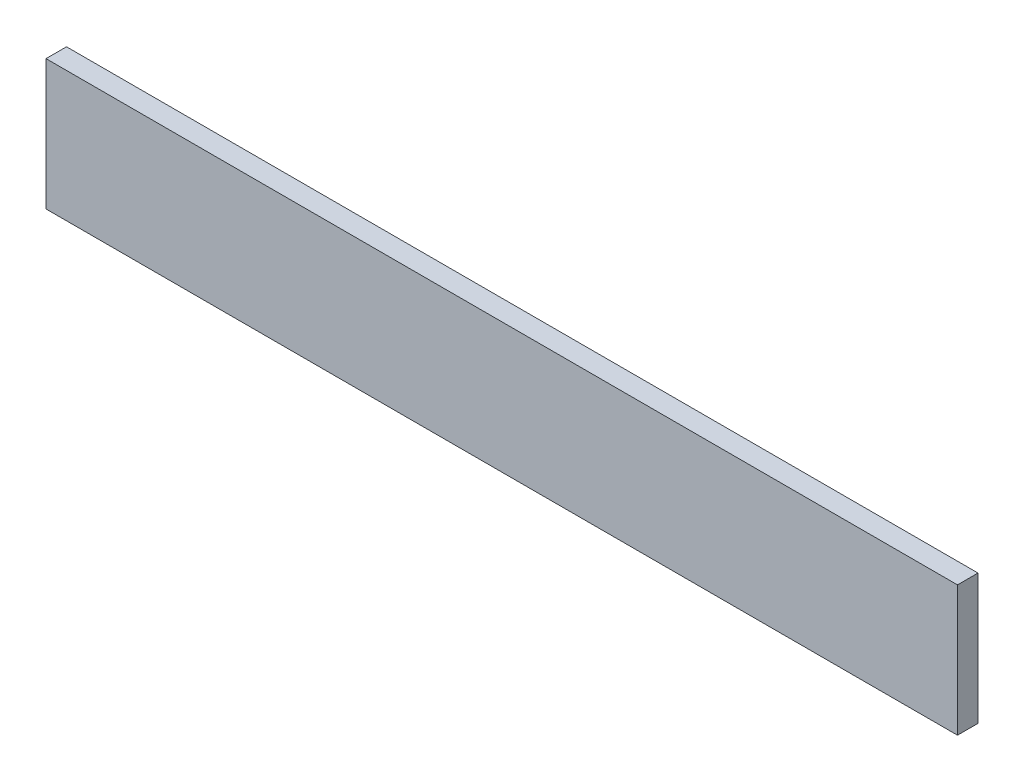
ISO-10303-21;
HEADER;
FILE_DESCRIPTION(('STEP AP214'),'2;1');
FILE_NAME('part.step','',(''),(''),'','','');
FILE_SCHEMA(('AUTOMOTIVE_DESIGN { 1 0 10303 214 1 1 1 1 }'));
ENDSEC;
DATA;
#1=APPLICATION_CONTEXT('core data for automotive mechanical design processes');
#2=APPLICATION_PROTOCOL_DEFINITION('international standard','automotive_design',2000,#1);
#3=PRODUCT_CONTEXT('',#1,'mechanical');
#4=PRODUCT('Part','Part','',(#3));
#5=PRODUCT_RELATED_PRODUCT_CATEGORY('part','',(#4));
#6=PRODUCT_DEFINITION_FORMATION('','',#4);
#7=PRODUCT_DEFINITION_CONTEXT('part definition',#1,'design');
#8=PRODUCT_DEFINITION('design','',#6,#7);
#9=PRODUCT_DEFINITION_SHAPE('','',#8);
#10=(LENGTH_UNIT() NAMED_UNIT(*) SI_UNIT(.MILLI.,.METRE.));
#11=(NAMED_UNIT(*) PLANE_ANGLE_UNIT() SI_UNIT($,.RADIAN.));
#12=(NAMED_UNIT(*) SI_UNIT($,.STERADIAN.) SOLID_ANGLE_UNIT());
#13=UNCERTAINTY_MEASURE_WITH_UNIT(LENGTH_MEASURE(1.E-05),#10,'distance_accuracy_value','');
#14=(GEOMETRIC_REPRESENTATION_CONTEXT(3) GLOBAL_UNCERTAINTY_ASSIGNED_CONTEXT((#13)) GLOBAL_UNIT_ASSIGNED_CONTEXT((#10,
#11,#12)) REPRESENTATION_CONTEXT('',''));
#15=CARTESIAN_POINT('',(0.,0.,0.));
#16=DIRECTION('',(0.,0.,1.));
#17=DIRECTION('',(1.,0.,0.));
#18=AXIS2_PLACEMENT_3D('',#15,#16,#17);
#19=CARTESIAN_POINT('',(-0.889,-0.127,0.03999992));
#20=DIRECTION('',(0.,0.,1.));
#21=DIRECTION('',(1.,0.,0.));
#22=AXIS2_PLACEMENT_3D('',#19,#20,#21);
#23=PLANE('',#22);
#24=DIRECTION('',(1.,0.,0.));
#25=VECTOR('',#24,1.);
#26=CARTESIAN_POINT('',(-0.889,0.127,0.03999992));
#27=LINE('',#26,#25);
#28=CARTESIAN_POINT('',(-0.889,0.127,0.03999992));
#29=VERTEX_POINT('',#28);
#30=CARTESIAN_POINT('',(0.889,0.127,0.03999992));
#31=VERTEX_POINT('',#30);
#32=EDGE_CURVE('E53',#29,#31,#27,.T.);
#33=ORIENTED_EDGE('',*,*,#32,.F.);
#34=DIRECTION('',(0.,1.,0.));
#35=VECTOR('',#34,1.);
#36=CARTESIAN_POINT('',(-0.889,-0.127,0.03999992));
#37=LINE('',#36,#35);
#38=CARTESIAN_POINT('',(-0.889,-0.127,0.03999992));
#39=VERTEX_POINT('',#38);
#40=EDGE_CURVE('E20',#29,#39,#37,.F.);
#41=ORIENTED_EDGE('',*,*,#40,.T.);
#42=DIRECTION('',(1.,0.,0.));
#43=VECTOR('',#42,1.);
#44=CARTESIAN_POINT('',(0.889,-0.127,0.03999992));
#45=LINE('',#44,#43);
#46=CARTESIAN_POINT('',(0.889,-0.127,0.03999992));
#47=VERTEX_POINT('',#46);
#48=EDGE_CURVE('E67',#47,#39,#45,.F.);
#49=ORIENTED_EDGE('',*,*,#48,.F.);
#50=DIRECTION('',(0.,1.,0.));
#51=VECTOR('',#50,1.);
#52=CARTESIAN_POINT('',(0.889,0.127,0.03999992));
#53=LINE('',#52,#51);
#54=EDGE_CURVE('E58',#31,#47,#53,.F.);
#55=ORIENTED_EDGE('',*,*,#54,.F.);
#56=EDGE_LOOP('',(#33,#41,#49,#55));
#57=FACE_BOUND('',#56,.T.);
#58=ADVANCED_FACE('F17',(#57),#23,.T.);
#59=CARTESIAN_POINT('',(0.889,-0.127,0.));
#60=DIRECTION('',(0.,-1.,0.));
#61=DIRECTION('',(0.,0.,-1.));
#62=AXIS2_PLACEMENT_3D('',#59,#60,#61);
#63=PLANE('',#62);
#64=DIRECTION('',(0.,0.,1.));
#65=VECTOR('',#64,1.);
#66=CARTESIAN_POINT('',(-0.889,-0.127,0.));
#67=LINE('',#66,#65);
#68=CARTESIAN_POINT('',(-0.889,-0.127,0.));
#69=VERTEX_POINT('',#68);
#70=EDGE_CURVE('E80',#69,#39,#67,.T.);
#71=ORIENTED_EDGE('',*,*,#70,.F.);
#72=DIRECTION('',(1.,0.,0.));
#73=VECTOR('',#72,1.);
#74=CARTESIAN_POINT('',(-0.889,-0.127,0.));
#75=LINE('',#74,#73);
#76=CARTESIAN_POINT('',(0.889,-0.127,0.));
#77=VERTEX_POINT('',#76);
#78=EDGE_CURVE('E75',#69,#77,#75,.T.);
#79=ORIENTED_EDGE('',*,*,#78,.T.);
#80=DIRECTION('',(0.,0.,-1.));
#81=VECTOR('',#80,1.);
#82=CARTESIAN_POINT('',(0.889,-0.127,0.));
#83=LINE('',#82,#81);
#84=EDGE_CURVE('E63',#47,#77,#83,.T.);
#85=ORIENTED_EDGE('',*,*,#84,.F.);
#86=ORIENTED_EDGE('',*,*,#48,.T.);
#87=EDGE_LOOP('',(#71,#79,#85,#86));
#88=FACE_BOUND('',#87,.T.);
#89=ADVANCED_FACE('F74',(#88),#63,.T.);
#90=CARTESIAN_POINT('',(0.889,0.127,0.));
#91=DIRECTION('',(1.,0.,0.));
#92=DIRECTION('',(0.,0.,-1.));
#93=AXIS2_PLACEMENT_3D('',#90,#91,#92);
#94=PLANE('',#93);
#95=ORIENTED_EDGE('',*,*,#84,.T.);
#96=DIRECTION('',(0.,1.,0.));
#97=VECTOR('',#96,1.);
#98=CARTESIAN_POINT('',(0.889,-0.127,0.));
#99=LINE('',#98,#97);
#100=CARTESIAN_POINT('',(0.889,0.127,0.));
#101=VERTEX_POINT('',#100);
#102=EDGE_CURVE('E84',#77,#101,#99,.T.);
#103=ORIENTED_EDGE('',*,*,#102,.T.);
#104=DIRECTION('',(0.,0.,1.));
#105=VECTOR('',#104,1.);
#106=CARTESIAN_POINT('',(0.889,0.127,0.));
#107=LINE('',#106,#105);
#108=EDGE_CURVE('E65',#31,#101,#107,.F.);
#109=ORIENTED_EDGE('',*,*,#108,.F.);
#110=ORIENTED_EDGE('',*,*,#54,.T.);
#111=EDGE_LOOP('',(#95,#103,#109,#110));
#112=FACE_BOUND('',#111,.T.);
#113=ADVANCED_FACE('F60',(#112),#94,.T.);
#114=CARTESIAN_POINT('',(-0.889,0.127,0.));
#115=DIRECTION('',(0.,1.,0.));
#116=DIRECTION('',(0.,0.,1.));
#117=AXIS2_PLACEMENT_3D('',#114,#115,#116);
#118=PLANE('',#117);
#119=ORIENTED_EDGE('',*,*,#108,.T.);
#120=DIRECTION('',(1.,0.,0.));
#121=VECTOR('',#120,1.);
#122=CARTESIAN_POINT('',(-0.889,0.127,0.));
#123=LINE('',#122,#121);
#124=CARTESIAN_POINT('',(-0.889,0.127,0.));
#125=VERTEX_POINT('',#124);
#126=EDGE_CURVE('E26',#101,#125,#123,.F.);
#127=ORIENTED_EDGE('',*,*,#126,.T.);
#128=DIRECTION('',(0.,0.,1.));
#129=VECTOR('',#128,1.);
#130=CARTESIAN_POINT('',(-0.889,0.127,0.));
#131=LINE('',#130,#129);
#132=EDGE_CURVE('E34',#29,#125,#131,.F.);
#133=ORIENTED_EDGE('',*,*,#132,.F.);
#134=ORIENTED_EDGE('',*,*,#32,.T.);
#135=EDGE_LOOP('',(#119,#127,#133,#134));
#136=FACE_BOUND('',#135,.T.);
#137=ADVANCED_FACE('F88',(#136),#118,.T.);
#138=CARTESIAN_POINT('',(-0.889,-0.127,0.));
#139=DIRECTION('',(-1.,0.,0.));
#140=DIRECTION('',(0.,0.,1.));
#141=AXIS2_PLACEMENT_3D('',#138,#139,#140);
#142=PLANE('',#141);
#143=ORIENTED_EDGE('',*,*,#132,.T.);
#144=DIRECTION('',(0.,1.,0.));
#145=VECTOR('',#144,1.);
#146=CARTESIAN_POINT('',(-0.889,-0.127,0.));
#147=LINE('',#146,#145);
#148=EDGE_CURVE('E11',#125,#69,#147,.F.);
#149=ORIENTED_EDGE('',*,*,#148,.T.);
#150=ORIENTED_EDGE('',*,*,#70,.T.);
#151=ORIENTED_EDGE('',*,*,#40,.F.);
#152=EDGE_LOOP('',(#143,#149,#150,#151));
#153=FACE_BOUND('',#152,.T.);
#154=ADVANCED_FACE('F91',(#153),#142,.T.);
#155=CARTESIAN_POINT('',(-0.889,-0.127,0.));
#156=DIRECTION('',(0.,0.,1.));
#157=DIRECTION('',(1.,0.,0.));
#158=AXIS2_PLACEMENT_3D('',#155,#156,#157);
#159=PLANE('',#158);
#160=ORIENTED_EDGE('',*,*,#126,.F.);
#161=ORIENTED_EDGE('',*,*,#102,.F.);
#162=ORIENTED_EDGE('',*,*,#78,.F.);
#163=ORIENTED_EDGE('',*,*,#148,.F.);
#164=EDGE_LOOP('',(#160,#161,#162,#163));
#165=FACE_BOUND('',#164,.T.);
#166=ADVANCED_FACE('F90',(#165),#159,.F.);
#167=CLOSED_SHELL('',(#58,#89,#113,#137,#154,#166));
#168=MANIFOLD_SOLID_BREP('B1',#167);
#169=ADVANCED_BREP_SHAPE_REPRESENTATION('',(#18,#168),#14);
#170=SHAPE_DEFINITION_REPRESENTATION(#9,#169);
ENDSEC;
END-ISO-10303-21;
